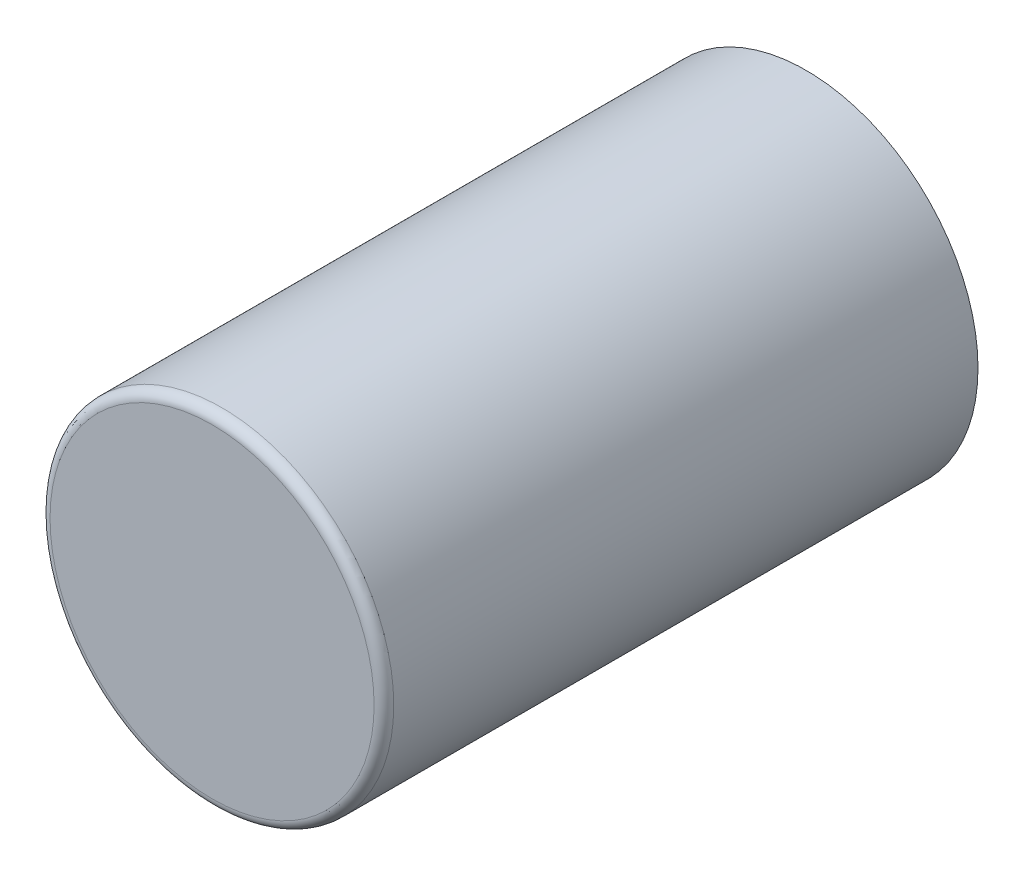
ISO-10303-21;
HEADER;
FILE_DESCRIPTION(('STEP AP214'),'2;1');
FILE_NAME('part.step','',(''),(''),'','','');
FILE_SCHEMA(('AUTOMOTIVE_DESIGN { 1 0 10303 214 1 1 1 1 }'));
ENDSEC;
DATA;
#1=APPLICATION_CONTEXT('core data for automotive mechanical design processes');
#2=APPLICATION_PROTOCOL_DEFINITION('international standard','automotive_design',2000,#1);
#3=PRODUCT_CONTEXT('',#1,'mechanical');
#4=PRODUCT('Part','Part','',(#3));
#5=PRODUCT_RELATED_PRODUCT_CATEGORY('part','',(#4));
#6=PRODUCT_DEFINITION_FORMATION('','',#4);
#7=PRODUCT_DEFINITION_CONTEXT('part definition',#1,'design');
#8=PRODUCT_DEFINITION('design','',#6,#7);
#9=PRODUCT_DEFINITION_SHAPE('','',#8);
#10=(LENGTH_UNIT() NAMED_UNIT(*) SI_UNIT(.MILLI.,.METRE.));
#11=(NAMED_UNIT(*) PLANE_ANGLE_UNIT() SI_UNIT($,.RADIAN.));
#12=(NAMED_UNIT(*) SI_UNIT($,.STERADIAN.) SOLID_ANGLE_UNIT());
#13=UNCERTAINTY_MEASURE_WITH_UNIT(LENGTH_MEASURE(1.E-05),#10,'distance_accuracy_value','');
#14=(GEOMETRIC_REPRESENTATION_CONTEXT(3) GLOBAL_UNCERTAINTY_ASSIGNED_CONTEXT((#13)) GLOBAL_UNIT_ASSIGNED_CONTEXT((#10,
#11,#12)) REPRESENTATION_CONTEXT('',''));
#15=CARTESIAN_POINT('',(0.,0.,0.));
#16=DIRECTION('',(0.,0.,1.));
#17=DIRECTION('',(1.,0.,0.));
#18=AXIS2_PLACEMENT_3D('',#15,#16,#17);
#19=CARTESIAN_POINT('',(0.,0.,9.5));
#20=DIRECTION('',(0.,0.,1.));
#21=DIRECTION('',(1.,0.,0.));
#22=AXIS2_PLACEMENT_3D('',#19,#20,#21);
#23=PLANE('',#22);
#24=CARTESIAN_POINT('',(0.,0.,9.5));
#25=DIRECTION('',(0.,0.,-1.));
#26=DIRECTION('',(1.,0.,0.));
#27=AXIS2_PLACEMENT_3D('',#24,#25,#26);
#28=CIRCLE('',#27,1.65);
#29=CARTESIAN_POINT('',(-1.65,0.,9.5));
#30=VERTEX_POINT('',#29);
#31=CARTESIAN_POINT('',(1.65,0.,9.5));
#32=VERTEX_POINT('',#31);
#33=EDGE_CURVE('E34',#30,#32,#28,.F.);
#34=ORIENTED_EDGE('',*,*,#33,.T.);
#35=CARTESIAN_POINT('',(0.,0.,9.5));
#36=DIRECTION('',(0.,0.,-1.));
#37=DIRECTION('',(-1.,0.,0.));
#38=AXIS2_PLACEMENT_3D('',#35,#36,#37);
#39=CIRCLE('',#38,1.65);
#40=EDGE_CURVE('E39',#30,#32,#39,.T.);
#41=ORIENTED_EDGE('',*,*,#40,.F.);
#42=EDGE_LOOP('',(#34,#41));
#43=FACE_BOUND('',#42,.T.);
#44=ADVANCED_FACE('F16',(#43),#23,.T.);
#45=CARTESIAN_POINT('',(0.,0.,3.45));
#46=DIRECTION('',(0.,0.,1.));
#47=DIRECTION('',(1.,0.,0.));
#48=AXIS2_PLACEMENT_3D('',#45,#46,#47);
#49=PLANE('',#48);
#50=CARTESIAN_POINT('',(0.,0.,3.45));
#51=DIRECTION('',(0.,0.,1.));
#52=DIRECTION('',(1.,0.,0.));
#53=AXIS2_PLACEMENT_3D('',#50,#51,#52);
#54=CIRCLE('',#53,1.75);
#55=CARTESIAN_POINT('',(1.75,0.,3.45));
#56=VERTEX_POINT('',#55);
#57=EDGE_CURVE('E28',#56,#56,#54,.T.);
#58=ORIENTED_EDGE('',*,*,#57,.F.);
#59=EDGE_LOOP('',(#58));
#60=FACE_BOUND('',#59,.T.);
#61=ADVANCED_FACE('F67',(#60),#49,.F.);
#62=CARTESIAN_POINT('',(0.,0.,9.4));
#63=DIRECTION('',(0.,0.,-1.));
#64=DIRECTION('',(-1.,0.,0.));
#65=AXIS2_PLACEMENT_3D('',#62,#63,#64);
#66=TOROIDAL_SURFACE('',#65,1.65,0.1);
#67=CARTESIAN_POINT('',(0.,0.,9.4));
#68=DIRECTION('',(0.,0.,1.));
#69=DIRECTION('',(1.,0.,0.));
#70=AXIS2_PLACEMENT_3D('',#67,#68,#69);
#71=CIRCLE('',#70,1.75);
#72=CARTESIAN_POINT('',(1.75,0.,9.4));
#73=VERTEX_POINT('',#72);
#74=EDGE_CURVE('E10',#73,#73,#71,.F.);
#75=ORIENTED_EDGE('',*,*,#74,.F.);
#76=EDGE_LOOP('',(#75));
#77=FACE_BOUND('',#76,.T.);
#78=ORIENTED_EDGE('',*,*,#40,.T.);
#79=ORIENTED_EDGE('',*,*,#33,.F.);
#80=EDGE_LOOP('',(#78,#79));
#81=FACE_BOUND('',#80,.T.);
#82=ADVANCED_FACE('F38',(#77,#81),#66,.T.);
#83=CARTESIAN_POINT('',(0.,0.,3.45));
#84=DIRECTION('',(0.,0.,1.));
#85=DIRECTION('',(1.,0.,0.));
#86=AXIS2_PLACEMENT_3D('',#83,#84,#85);
#87=CYLINDRICAL_SURFACE('',#86,1.75);
#88=ORIENTED_EDGE('',*,*,#57,.T.);
#89=EDGE_LOOP('',(#88));
#90=FACE_BOUND('',#89,.T.);
#91=ORIENTED_EDGE('',*,*,#74,.T.);
#92=EDGE_LOOP('',(#91));
#93=FACE_BOUND('',#92,.T.);
#94=ADVANCED_FACE('F66',(#90,#93),#87,.T.);
#95=CLOSED_SHELL('',(#44,#61,#82,#94));
#96=MANIFOLD_SOLID_BREP('B1',#95);
#97=ADVANCED_BREP_SHAPE_REPRESENTATION('',(#18,#96),#14);
#98=SHAPE_DEFINITION_REPRESENTATION(#9,#97);
ENDSEC;
END-ISO-10303-21;
